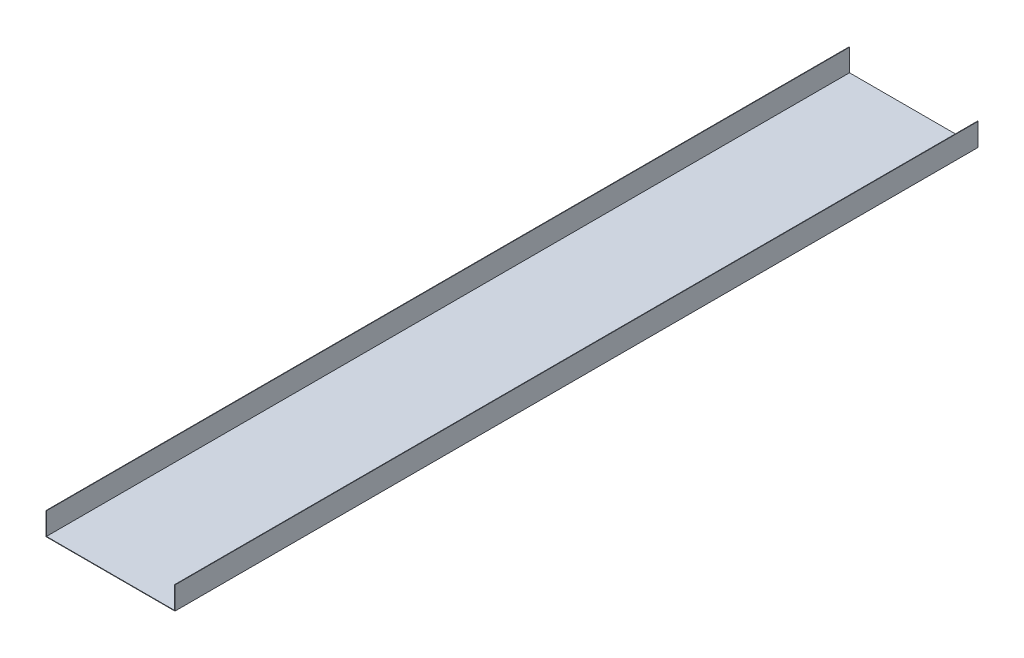
ISO-10303-21;
HEADER;
FILE_DESCRIPTION(('STEP AP214'),'2;1');
FILE_NAME('part.step','',(''),(''),'','','');
FILE_SCHEMA(('AUTOMOTIVE_DESIGN { 1 0 10303 214 1 1 1 1 }'));
ENDSEC;
DATA;
#1=APPLICATION_CONTEXT('core data for automotive mechanical design processes');
#2=APPLICATION_PROTOCOL_DEFINITION('international standard','automotive_design',2000,#1);
#3=PRODUCT_CONTEXT('',#1,'mechanical');
#4=PRODUCT('Part','Part','',(#3));
#5=PRODUCT_RELATED_PRODUCT_CATEGORY('part','',(#4));
#6=PRODUCT_DEFINITION_FORMATION('','',#4);
#7=PRODUCT_DEFINITION_CONTEXT('part definition',#1,'design');
#8=PRODUCT_DEFINITION('design','',#6,#7);
#9=PRODUCT_DEFINITION_SHAPE('','',#8);
#10=(LENGTH_UNIT() NAMED_UNIT(*) SI_UNIT(.MILLI.,.METRE.));
#11=(NAMED_UNIT(*) PLANE_ANGLE_UNIT() SI_UNIT($,.RADIAN.));
#12=(NAMED_UNIT(*) SI_UNIT($,.STERADIAN.) SOLID_ANGLE_UNIT());
#13=UNCERTAINTY_MEASURE_WITH_UNIT(LENGTH_MEASURE(1.E-05),#10,'distance_accuracy_value','');
#14=(GEOMETRIC_REPRESENTATION_CONTEXT(3) GLOBAL_UNCERTAINTY_ASSIGNED_CONTEXT((#13)) GLOBAL_UNIT_ASSIGNED_CONTEXT((#10,
#11,#12)) REPRESENTATION_CONTEXT('',''));
#15=CARTESIAN_POINT('',(0.,0.,0.));
#16=DIRECTION('',(0.,0.,1.));
#17=DIRECTION('',(1.,0.,0.));
#18=AXIS2_PLACEMENT_3D('',#15,#16,#17);
#19=CARTESIAN_POINT('',(-6775.,-50.,42500.));
#20=DIRECTION('',(0.,0.,1.));
#21=DIRECTION('',(1.,0.,0.));
#22=AXIS2_PLACEMENT_3D('',#19,#20,#21);
#23=PLANE('',#22);
#24=DIRECTION('',(1.,0.,0.));
#25=VECTOR('',#24,1.);
#26=CARTESIAN_POINT('',(-6775.,0.,42500.));
#27=LINE('',#26,#25);
#28=CARTESIAN_POINT('',(-6775.,0.,42500.));
#29=VERTEX_POINT('',#28);
#30=CARTESIAN_POINT('',(6775.,0.,42500.));
#31=VERTEX_POINT('',#30);
#32=EDGE_CURVE('E36',#29,#31,#27,.T.);
#33=ORIENTED_EDGE('',*,*,#32,.F.);
#34=DIRECTION('',(0.,1.,0.));
#35=VECTOR('',#34,1.);
#36=CARTESIAN_POINT('',(-6775.,-50.,42500.));
#37=LINE('',#36,#35);
#38=CARTESIAN_POINT('',(-6775.,2350.,42500.));
#39=VERTEX_POINT('',#38);
#40=EDGE_CURVE('E49',#29,#39,#37,.T.);
#41=ORIENTED_EDGE('',*,*,#40,.T.);
#42=DIRECTION('',(-1.,0.,0.));
#43=VECTOR('',#42,1.);
#44=CARTESIAN_POINT('',(-6775.,2350.,42500.));
#45=LINE('',#44,#43);
#46=CARTESIAN_POINT('',(-6824.99999999999,2350.,42500.));
#47=VERTEX_POINT('',#46);
#48=EDGE_CURVE('E133',#39,#47,#45,.T.);
#49=ORIENTED_EDGE('',*,*,#48,.T.);
#50=DIRECTION('',(0.,-1.,0.));
#51=VECTOR('',#50,1.);
#52=CARTESIAN_POINT('',(-6824.99999999999,-49.9999999999998,42500.));
#53=LINE('',#52,#51);
#54=CARTESIAN_POINT('',(-6824.99999999999,-49.9999999999998,42500.));
#55=VERTEX_POINT('',#54);
#56=EDGE_CURVE('E129',#47,#55,#53,.T.);
#57=ORIENTED_EDGE('',*,*,#56,.T.);
#58=DIRECTION('',(1.,0.,0.));
#59=VECTOR('',#58,1.);
#60=CARTESIAN_POINT('',(-6775.,-50.,42500.));
#61=LINE('',#60,#59);
#62=CARTESIAN_POINT('',(6824.99999999999,-49.9999999999998,42500.));
#63=VERTEX_POINT('',#62);
#64=EDGE_CURVE('E11',#55,#63,#61,.T.);
#65=ORIENTED_EDGE('',*,*,#64,.T.);
#66=DIRECTION('',(0.,1.,0.));
#67=VECTOR('',#66,1.);
#68=CARTESIAN_POINT('',(6824.99999999999,-49.9999999999998,42500.));
#69=LINE('',#68,#67);
#70=CARTESIAN_POINT('',(6824.99999999999,2350.,42500.));
#71=VERTEX_POINT('',#70);
#72=EDGE_CURVE('E124',#63,#71,#69,.T.);
#73=ORIENTED_EDGE('',*,*,#72,.T.);
#74=DIRECTION('',(-1.,0.,0.));
#75=VECTOR('',#74,1.);
#76=CARTESIAN_POINT('',(6775.,2350.,42500.));
#77=LINE('',#76,#75);
#78=CARTESIAN_POINT('',(6775.,2350.,42500.));
#79=VERTEX_POINT('',#78);
#80=EDGE_CURVE('E110',#71,#79,#77,.T.);
#81=ORIENTED_EDGE('',*,*,#80,.T.);
#82=DIRECTION('',(0.,-1.,0.));
#83=VECTOR('',#82,1.);
#84=CARTESIAN_POINT('',(6775.,-50.,42500.));
#85=LINE('',#84,#83);
#86=EDGE_CURVE('E118',#79,#31,#85,.T.);
#87=ORIENTED_EDGE('',*,*,#86,.T.);
#88=EDGE_LOOP('',(#33,#41,#49,#57,#65,#73,#81,#87));
#89=FACE_BOUND('',#88,.T.);
#90=ADVANCED_FACE('F32',(#89),#23,.T.);
#91=CARTESIAN_POINT('',(-6775.00000000001,-50.,-42500.));
#92=DIRECTION('',(0.,0.,-1.));
#93=DIRECTION('',(-1.,0.,0.));
#94=AXIS2_PLACEMENT_3D('',#91,#92,#93);
#95=PLANE('',#94);
#96=DIRECTION('',(-1.,0.,0.));
#97=VECTOR('',#96,1.);
#98=CARTESIAN_POINT('',(-6775.00000000001,0.,-42500.));
#99=LINE('',#98,#97);
#100=CARTESIAN_POINT('',(6775.,0.,-42500.));
#101=VERTEX_POINT('',#100);
#102=CARTESIAN_POINT('',(-6775.,0.,-42500.));
#103=VERTEX_POINT('',#102);
#104=EDGE_CURVE('E155',#101,#103,#99,.T.);
#105=ORIENTED_EDGE('',*,*,#104,.F.);
#106=DIRECTION('',(0.,-1.,0.));
#107=VECTOR('',#106,1.);
#108=CARTESIAN_POINT('',(6775.,-50.,-42500.));
#109=LINE('',#108,#107);
#110=CARTESIAN_POINT('',(6775.,2350.,-42500.));
#111=VERTEX_POINT('',#110);
#112=EDGE_CURVE('E57',#111,#101,#109,.T.);
#113=ORIENTED_EDGE('',*,*,#112,.F.);
#114=DIRECTION('',(-1.,0.,0.));
#115=VECTOR('',#114,1.);
#116=CARTESIAN_POINT('',(6775.,2350.,-42500.));
#117=LINE('',#116,#115);
#118=CARTESIAN_POINT('',(6824.99999999999,2350.,-42500.));
#119=VERTEX_POINT('',#118);
#120=EDGE_CURVE('E98',#119,#111,#117,.T.);
#121=ORIENTED_EDGE('',*,*,#120,.F.);
#122=DIRECTION('',(0.,1.,0.));
#123=VECTOR('',#122,1.);
#124=CARTESIAN_POINT('',(6824.99999999999,-49.9999999999998,-42500.));
#125=LINE('',#124,#123);
#126=CARTESIAN_POINT('',(6824.99999999999,-49.9999999999998,-42500.));
#127=VERTEX_POINT('',#126);
#128=EDGE_CURVE('E101',#127,#119,#125,.T.);
#129=ORIENTED_EDGE('',*,*,#128,.F.);
#130=DIRECTION('',(-1.,0.,0.));
#131=VECTOR('',#130,1.);
#132=CARTESIAN_POINT('',(-6775.00000000001,-50.,-42500.));
#133=LINE('',#132,#131);
#134=CARTESIAN_POINT('',(-6824.99999999999,-49.9999999999998,-42500.));
#135=VERTEX_POINT('',#134);
#136=EDGE_CURVE('E41',#127,#135,#133,.T.);
#137=ORIENTED_EDGE('',*,*,#136,.T.);
#138=DIRECTION('',(0.,-1.,0.));
#139=VECTOR('',#138,1.);
#140=CARTESIAN_POINT('',(-6824.99999999999,-49.9999999999998,-42500.));
#141=LINE('',#140,#139);
#142=CARTESIAN_POINT('',(-6824.99999999999,2350.,-42500.));
#143=VERTEX_POINT('',#142);
#144=EDGE_CURVE('E144',#143,#135,#141,.T.);
#145=ORIENTED_EDGE('',*,*,#144,.F.);
#146=DIRECTION('',(-1.,0.,0.));
#147=VECTOR('',#146,1.);
#148=CARTESIAN_POINT('',(-6775.,2350.,-42500.));
#149=LINE('',#148,#147);
#150=CARTESIAN_POINT('',(-6775.,2350.,-42500.));
#151=VERTEX_POINT('',#150);
#152=EDGE_CURVE('E132',#151,#143,#149,.T.);
#153=ORIENTED_EDGE('',*,*,#152,.F.);
#154=DIRECTION('',(0.,1.,0.));
#155=VECTOR('',#154,1.);
#156=CARTESIAN_POINT('',(-6775.,-50.,-42500.));
#157=LINE('',#156,#155);
#158=EDGE_CURVE('E140',#103,#151,#157,.T.);
#159=ORIENTED_EDGE('',*,*,#158,.F.);
#160=EDGE_LOOP('',(#105,#113,#121,#129,#137,#145,#153,#159));
#161=FACE_BOUND('',#160,.T.);
#162=ADVANCED_FACE('F34',(#161),#95,.T.);
#163=CARTESIAN_POINT('',(0.,-50.,0.));
#164=DIRECTION('',(0.,1.,0.));
#165=DIRECTION('',(0.,0.,1.));
#166=AXIS2_PLACEMENT_3D('',#163,#164,#165);
#167=PLANE('',#166);
#168=ORIENTED_EDGE('',*,*,#136,.F.);
#169=DIRECTION('',(0.,0.,1.));
#170=VECTOR('',#169,1.);
#171=CARTESIAN_POINT('',(6824.99999999999,-49.9999999999998,-44900.5207768316));
#172=LINE('',#171,#170);
#173=EDGE_CURVE('E117',#127,#63,#172,.T.);
#174=ORIENTED_EDGE('',*,*,#173,.T.);
#175=ORIENTED_EDGE('',*,*,#64,.F.);
#176=DIRECTION('',(0.,0.,1.));
#177=VECTOR('',#176,1.);
#178=CARTESIAN_POINT('',(-6824.99999999999,-49.9999999999998,-44900.5207768316));
#179=LINE('',#178,#177);
#180=EDGE_CURVE('E143',#135,#55,#179,.T.);
#181=ORIENTED_EDGE('',*,*,#180,.F.);
#182=EDGE_LOOP('',(#168,#174,#175,#181));
#183=FACE_BOUND('',#182,.T.);
#184=ADVANCED_FACE('F181',(#183),#167,.F.);
#185=CARTESIAN_POINT('',(0.,0.,0.));
#186=DIRECTION('',(0.,1.,0.));
#187=DIRECTION('',(0.,0.,1.));
#188=AXIS2_PLACEMENT_3D('',#185,#186,#187);
#189=PLANE('',#188);
#190=DIRECTION('',(0.,0.,-1.));
#191=VECTOR('',#190,1.);
#192=CARTESIAN_POINT('',(6775.,0.,-42500.));
#193=LINE('',#192,#191);
#194=EDGE_CURVE('E151',#31,#101,#193,.T.);
#195=ORIENTED_EDGE('',*,*,#194,.T.);
#196=ORIENTED_EDGE('',*,*,#104,.T.);
#197=DIRECTION('',(0.,0.,1.));
#198=VECTOR('',#197,1.);
#199=CARTESIAN_POINT('',(-6775.00000000001,0.,-42500.));
#200=LINE('',#199,#198);
#201=EDGE_CURVE('E157',#103,#29,#200,.T.);
#202=ORIENTED_EDGE('',*,*,#201,.T.);
#203=ORIENTED_EDGE('',*,*,#32,.T.);
#204=EDGE_LOOP('',(#195,#196,#202,#203));
#205=FACE_BOUND('',#204,.T.);
#206=ADVANCED_FACE('F161',(#205),#189,.T.);
#207=CARTESIAN_POINT('',(-6775.,-50.,-44900.5207768316));
#208=DIRECTION('',(1.,0.,0.));
#209=DIRECTION('',(0.,0.,-1.));
#210=AXIS2_PLACEMENT_3D('',#207,#208,#209);
#211=PLANE('',#210);
#212=ORIENTED_EDGE('',*,*,#201,.F.);
#213=ORIENTED_EDGE('',*,*,#158,.T.);
#214=DIRECTION('',(0.,0.,1.));
#215=VECTOR('',#214,1.);
#216=CARTESIAN_POINT('',(-6775.,2350.,-44900.5207768316));
#217=LINE('',#216,#215);
#218=EDGE_CURVE('E142',#151,#39,#217,.T.);
#219=ORIENTED_EDGE('',*,*,#218,.T.);
#220=ORIENTED_EDGE('',*,*,#40,.F.);
#221=EDGE_LOOP('',(#212,#213,#219,#220));
#222=FACE_BOUND('',#221,.T.);
#223=ADVANCED_FACE('F185',(#222),#211,.T.);
#224=CARTESIAN_POINT('',(-6775.,2350.,-44900.5207768316));
#225=DIRECTION('',(0.,1.,0.));
#226=DIRECTION('',(-1.,0.,0.));
#227=AXIS2_PLACEMENT_3D('',#224,#225,#226);
#228=PLANE('',#227);
#229=ORIENTED_EDGE('',*,*,#218,.F.);
#230=ORIENTED_EDGE('',*,*,#152,.T.);
#231=DIRECTION('',(0.,0.,1.));
#232=VECTOR('',#231,1.);
#233=CARTESIAN_POINT('',(-6824.99999999999,2350.,-44900.5207768316));
#234=LINE('',#233,#232);
#235=EDGE_CURVE('E139',#143,#47,#234,.T.);
#236=ORIENTED_EDGE('',*,*,#235,.T.);
#237=ORIENTED_EDGE('',*,*,#48,.F.);
#238=EDGE_LOOP('',(#229,#230,#236,#237));
#239=FACE_BOUND('',#238,.T.);
#240=ADVANCED_FACE('F173',(#239),#228,.T.);
#241=CARTESIAN_POINT('',(-6824.99999999999,-49.9999999999998,-44900.5207768316));
#242=DIRECTION('',(-1.,0.,0.));
#243=DIRECTION('',(0.,0.,1.));
#244=AXIS2_PLACEMENT_3D('',#241,#242,#243);
#245=PLANE('',#244);
#246=ORIENTED_EDGE('',*,*,#235,.F.);
#247=ORIENTED_EDGE('',*,*,#144,.T.);
#248=ORIENTED_EDGE('',*,*,#180,.T.);
#249=ORIENTED_EDGE('',*,*,#56,.F.);
#250=EDGE_LOOP('',(#246,#247,#248,#249));
#251=FACE_BOUND('',#250,.T.);
#252=ADVANCED_FACE('F166',(#251),#245,.T.);
#253=CARTESIAN_POINT('',(6775.,-50.,-44900.5207768316));
#254=DIRECTION('',(-1.,0.,0.));
#255=DIRECTION('',(0.,0.,1.));
#256=AXIS2_PLACEMENT_3D('',#253,#254,#255);
#257=PLANE('',#256);
#258=ORIENTED_EDGE('',*,*,#194,.F.);
#259=ORIENTED_EDGE('',*,*,#86,.F.);
#260=DIRECTION('',(0.,0.,1.));
#261=VECTOR('',#260,1.);
#262=CARTESIAN_POINT('',(6775.,2350.,-44900.5207768316));
#263=LINE('',#262,#261);
#264=EDGE_CURVE('E104',#111,#79,#263,.T.);
#265=ORIENTED_EDGE('',*,*,#264,.F.);
#266=ORIENTED_EDGE('',*,*,#112,.T.);
#267=EDGE_LOOP('',(#258,#259,#265,#266));
#268=FACE_BOUND('',#267,.T.);
#269=ADVANCED_FACE('F164',(#268),#257,.T.);
#270=CARTESIAN_POINT('',(6824.99999999999,-49.9999999999998,-44900.5207768316));
#271=DIRECTION('',(1.,0.,0.));
#272=DIRECTION('',(0.,0.,-1.));
#273=AXIS2_PLACEMENT_3D('',#270,#271,#272);
#274=PLANE('',#273);
#275=ORIENTED_EDGE('',*,*,#173,.F.);
#276=ORIENTED_EDGE('',*,*,#128,.T.);
#277=DIRECTION('',(0.,0.,1.));
#278=VECTOR('',#277,1.);
#279=CARTESIAN_POINT('',(6824.99999999999,2350.,-44900.5207768316));
#280=LINE('',#279,#278);
#281=EDGE_CURVE('E105',#119,#71,#280,.T.);
#282=ORIENTED_EDGE('',*,*,#281,.T.);
#283=ORIENTED_EDGE('',*,*,#72,.F.);
#284=EDGE_LOOP('',(#275,#276,#282,#283));
#285=FACE_BOUND('',#284,.T.);
#286=ADVANCED_FACE('F115',(#285),#274,.T.);
#287=CARTESIAN_POINT('',(6775.,2350.,-44900.5207768316));
#288=DIRECTION('',(0.,1.,0.));
#289=DIRECTION('',(-1.,0.,0.));
#290=AXIS2_PLACEMENT_3D('',#287,#288,#289);
#291=PLANE('',#290);
#292=ORIENTED_EDGE('',*,*,#281,.F.);
#293=ORIENTED_EDGE('',*,*,#120,.T.);
#294=ORIENTED_EDGE('',*,*,#264,.T.);
#295=ORIENTED_EDGE('',*,*,#80,.F.);
#296=EDGE_LOOP('',(#292,#293,#294,#295));
#297=FACE_BOUND('',#296,.T.);
#298=ADVANCED_FACE('F108',(#297),#291,.T.);
#299=CLOSED_SHELL('',(#90,#162,#184,#206,#223,#240,#252,#269,#286,#298));
#300=MANIFOLD_SOLID_BREP('B2',#299);
#301=ADVANCED_BREP_SHAPE_REPRESENTATION('',(#18,#300),#14);
#302=SHAPE_DEFINITION_REPRESENTATION(#9,#301);
ENDSEC;
END-ISO-10303-21;
